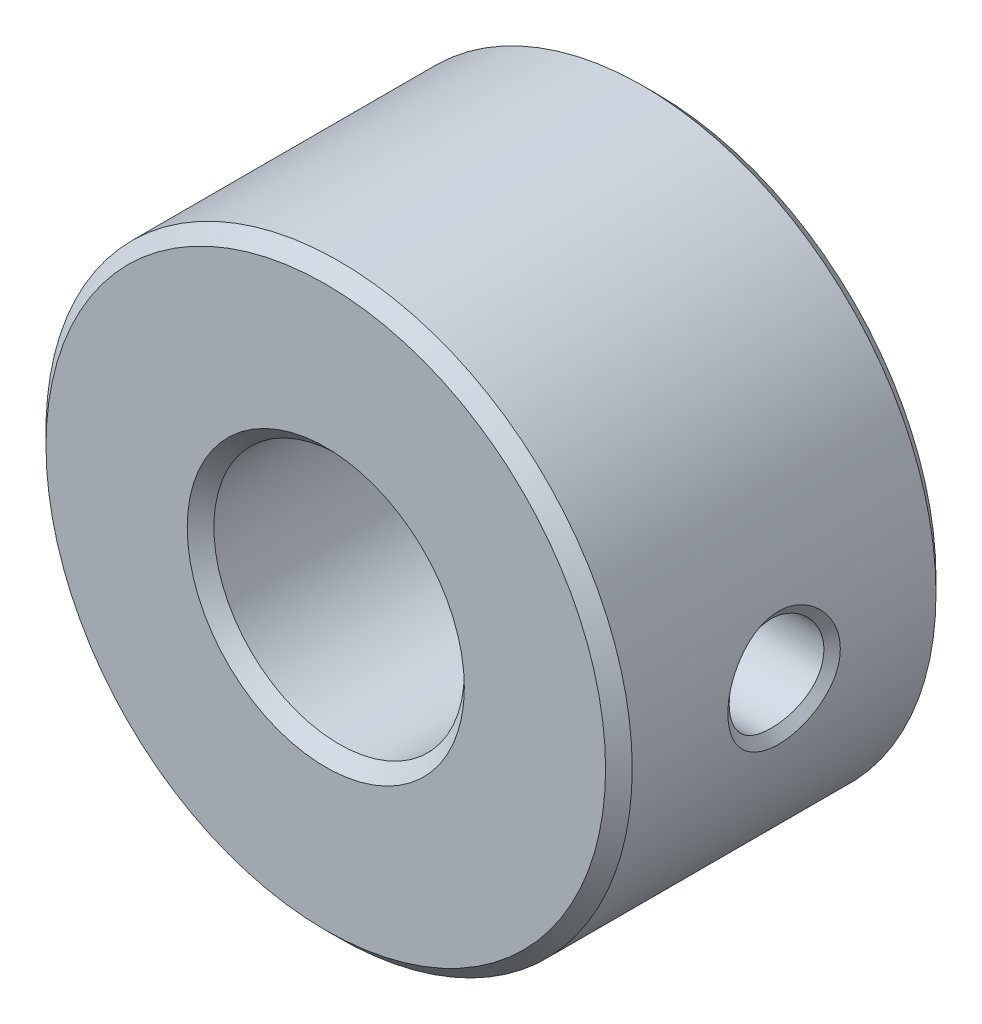
ISO-10303-21;
HEADER;
FILE_DESCRIPTION(('STEP AP214'),'2;1');
FILE_NAME('part.step','',(''),(''),'','','');
FILE_SCHEMA(('AUTOMOTIVE_DESIGN { 1 0 10303 214 1 1 1 1 }'));
ENDSEC;
DATA;
#1=APPLICATION_CONTEXT('core data for automotive mechanical design processes');
#2=APPLICATION_PROTOCOL_DEFINITION('international standard','automotive_design',2000,#1);
#3=PRODUCT_CONTEXT('',#1,'mechanical');
#4=PRODUCT('Part','Part','',(#3));
#5=PRODUCT_RELATED_PRODUCT_CATEGORY('part','',(#4));
#6=PRODUCT_DEFINITION_FORMATION('','',#4);
#7=PRODUCT_DEFINITION_CONTEXT('part definition',#1,'design');
#8=PRODUCT_DEFINITION('design','',#6,#7);
#9=PRODUCT_DEFINITION_SHAPE('','',#8);
#10=(LENGTH_UNIT() NAMED_UNIT(*) SI_UNIT(.MILLI.,.METRE.));
#11=(NAMED_UNIT(*) PLANE_ANGLE_UNIT() SI_UNIT($,.RADIAN.));
#12=(NAMED_UNIT(*) SI_UNIT($,.STERADIAN.) SOLID_ANGLE_UNIT());
#13=UNCERTAINTY_MEASURE_WITH_UNIT(LENGTH_MEASURE(1.E-05),#10,'distance_accuracy_value','');
#14=(GEOMETRIC_REPRESENTATION_CONTEXT(3) GLOBAL_UNCERTAINTY_ASSIGNED_CONTEXT((#13)) GLOBAL_UNIT_ASSIGNED_CONTEXT((#10,
#11,#12)) REPRESENTATION_CONTEXT('',''));
#15=CARTESIAN_POINT('',(0.,0.,0.));
#16=DIRECTION('',(0.,0.,1.));
#17=DIRECTION('',(1.,0.,0.));
#18=AXIS2_PLACEMENT_3D('',#15,#16,#17);
#19=CARTESIAN_POINT('',(0.,0.,-3.1));
#20=DIRECTION('',(0.,0.,1.));
#21=DIRECTION('',(1.,0.,0.));
#22=AXIS2_PLACEMENT_3D('',#19,#20,#21);
#23=CYLINDRICAL_SURFACE('',#22,5.5);
#24=CARTESIAN_POINT('',(5.5,0.,1.05445517417809));
#25=CARTESIAN_POINT('',(5.49999896020636,-0.0587760500050583,1.05445216947384));
#26=CARTESIAN_POINT('',(5.49904821126584,-0.117580576492319,1.04960013701573));
#27=CARTESIAN_POINT('',(5.49534665161718,-0.233534231011388,1.0302117236521));
#28=CARTESIAN_POINT('',(5.49259472262229,-0.290682307580186,1.01566932625227));
#29=CARTESIAN_POINT('',(5.48559027774952,-0.401743932731734,0.977473891884128));
#30=CARTESIAN_POINT('',(5.4813375821966,-0.455657093118598,0.953819764008493));
#31=CARTESIAN_POINT('',(5.47176191891798,-0.559040571617917,0.898217195347256));
#32=CARTESIAN_POINT('',(5.46643674682971,-0.60850143046409,0.866251631238485));
#33=CARTESIAN_POINT('',(5.45499571938975,-0.703869507656749,0.793406345771751));
#34=CARTESIAN_POINT('',(5.44885508389665,-0.749517093762313,0.752190549515752));
#35=CARTESIAN_POINT('',(5.43664239318371,-0.833500494132551,0.6628736362932));
#36=CARTESIAN_POINT('',(5.4305703398318,-0.87183610969594,0.61477233227656));
#37=CARTESIAN_POINT('',(5.41899723927629,-0.941140664304011,0.511127115790833));
#38=CARTESIAN_POINT('',(5.41352107934706,-0.971830552407547,0.455392501688934));
#39=CARTESIAN_POINT('',(5.40413531087428,-1.02273963029988,0.33922834945272));
#40=CARTESIAN_POINT('',(5.40022428671862,-1.04296828678008,0.27880311316901));
#41=CARTESIAN_POINT('',(5.39481500784806,-1.07058952823278,0.159311485043026));
#42=CARTESIAN_POINT('',(5.3931687796178,-1.07877209846978,0.100439438138129));
#43=CARTESIAN_POINT('',(5.3923762817735,-1.08271605936146,0.0118249521786019));
#44=CARTESIAN_POINT('',(5.39239173208748,-1.08264169135826,-0.0177692290999034));
#45=CARTESIAN_POINT('',(5.39297661284685,-1.0797249904411,-0.0768167413581013));
#46=CARTESIAN_POINT('',(5.39354606449186,-1.07688255160313,-0.106270066904415));
#47=CARTESIAN_POINT('',(5.39586876641908,-1.06520609135072,-0.187914008471301));
#48=CARTESIAN_POINT('',(5.39820177552338,-1.05341293578653,-0.239689226629195));
#49=CARTESIAN_POINT('',(5.40424502443843,-1.02195284613962,-0.340679597737544));
#50=CARTESIAN_POINT('',(5.40795602152946,-1.0022815821348,-0.389893326020878));
#51=CARTESIAN_POINT('',(5.41660742866317,-0.954457567838482,-0.487746547031284));
#52=CARTESIAN_POINT('',(5.42161000958073,-0.92585291310056,-0.536159410304942));
#53=CARTESIAN_POINT('',(5.43218043414666,-0.861668557394924,-0.628054789180558));
#54=CARTESIAN_POINT('',(5.43774857766158,-0.826085146820256,-0.671534663129555));
#55=CARTESIAN_POINT('',(5.44949798144761,-0.744862917925946,-0.756887133942376));
#56=CARTESIAN_POINT('',(5.45568348475164,-0.698566742460576,-0.798136163284172));
#57=CARTESIAN_POINT('',(5.46742818057992,-0.599751995803934,-0.872480727533195));
#58=CARTESIAN_POINT('',(5.47298729741344,-0.547232674195469,-0.90557527764897));
#59=CARTESIAN_POINT('',(5.48296145927168,-0.436224345908251,-0.963028372348672));
#60=CARTESIAN_POINT('',(5.48735312350446,-0.377641945218175,-0.987211665936841));
#61=CARTESIAN_POINT('',(5.49432213252549,-0.257030077639985,-1.02488024075925));
#62=CARTESIAN_POINT('',(5.4969000866694,-0.195001776042029,-1.03836911521153));
#63=CARTESIAN_POINT('',(5.49983828794837,-0.0728715082958026,-1.05366828215213));
#64=CARTESIAN_POINT('',(5.5003102653694,-0.0128451476138093,-1.056067203853));
#65=CARTESIAN_POINT('',(5.49928899831789,0.106738912878901,-1.05078008465892));
#66=CARTESIAN_POINT('',(5.49779611835931,0.166296697556492,-1.04309591434723));
#67=CARTESIAN_POINT('',(5.49306057031608,0.282111855788843,-1.0180521613273));
#68=CARTESIAN_POINT('',(5.48985054069155,0.338409754204948,-1.00087285974433));
#69=CARTESIAN_POINT('',(5.48204618004218,0.447390698197375,-0.957669816485664));
#70=CARTESIAN_POINT('',(5.47745160259369,0.500073098231542,-0.931644500278961));
#71=CARTESIAN_POINT('',(5.46720486976661,0.601968982768803,-0.870828079281042));
#72=CARTESIAN_POINT('',(5.46152721764154,0.651048115191046,-0.835816617213848));
#73=CARTESIAN_POINT('',(5.44978420217876,0.742968781136662,-0.758437893859749));
#74=CARTESIAN_POINT('',(5.44371875037234,0.785808883991697,-0.716068950300854));
#75=CARTESIAN_POINT('',(5.43152230698235,0.866200882384876,-0.622636968824208));
#76=CARTESIAN_POINT('',(5.42540404542126,0.903366496466702,-0.571238417038618));
#77=CARTESIAN_POINT('',(5.41419672181722,0.968278556990153,-0.462671109924364));
#78=CARTESIAN_POINT('',(5.40910757826645,0.996025749504273,-0.405502812107012));
#79=CARTESIAN_POINT('',(5.40083515022377,1.03993557409867,-0.288859287707341));
#80=CARTESIAN_POINT('',(5.39759486381485,1.05644810985702,-0.229521096907953));
#81=CARTESIAN_POINT('',(5.39332419630135,1.07804616566032,-0.108755570616923));
#82=CARTESIAN_POINT('',(5.39229040807193,1.08314930390275,-0.0473316050697027));
#83=CARTESIAN_POINT('',(5.39263780314379,1.08141189138572,0.0683148990326293));
#84=CARTESIAN_POINT('',(5.3937577340568,1.075863537526,0.122562062377802));
#85=CARTESIAN_POINT('',(5.39769832636335,1.05591414650463,0.229347188850656));
#86=CARTESIAN_POINT('',(5.40052005819541,1.04150753735923,0.281884054255267));
#87=CARTESIAN_POINT('',(5.4074870106664,1.00470438060552,0.383849659286823));
#88=CARTESIAN_POINT('',(5.41162980571736,0.98232246757917,0.433283898061735));
#89=CARTESIAN_POINT('',(5.42078866935544,0.930452999349249,0.528193084690469));
#90=CARTESIAN_POINT('',(5.42580524039021,0.900961352064953,0.573665731815432));
#91=CARTESIAN_POINT('',(5.43682195918505,0.832054380877992,0.66464826655606));
#92=CARTESIAN_POINT('',(5.44286934372901,0.791897644604223,0.709592210349386));
#93=CARTESIAN_POINT('',(5.45481850387052,0.70489879266957,0.792533387935634));
#94=CARTESIAN_POINT('',(5.460720184184,0.658052431370331,0.830526174904873));
#95=CARTESIAN_POINT('',(5.47206389682312,0.55612999252404,0.900315538286906));
#96=CARTESIAN_POINT('',(5.47746483506484,0.500748866809206,0.931675534720241));
#97=CARTESIAN_POINT('',(5.48679099300324,0.385306536172519,0.984276471464426));
#98=CARTESIAN_POINT('',(5.49071824081634,0.325251901548179,1.00553132947076));
#99=CARTESIAN_POINT('',(5.49573737793324,0.220758146112437,1.0322857658789));
#100=CARTESIAN_POINT('',(5.49732655410275,0.177044915514125,1.04059981614714));
#101=CARTESIAN_POINT('',(5.49945828933617,0.088893248475983,1.05168582063715));
#102=CARTESIAN_POINT('',(5.50000078643914,0.0444547692601643,1.05445744676078));
#103=CARTESIAN_POINT('',(5.5,0.,1.05445517417809));
#104=B_SPLINE_CURVE_WITH_KNOTS('',3,(#24,#25,#26,#27,#28,#29,#30,#31,#32,#33,#34,#35,#36,#37,
#38,#39,#40,#41,#42,#43,#44,#45,#46,#47,#48,#49,#50,#51,#52,#53,#54,#55,#56,#57,#58,#59,#60,#61,
#62,#63,#64,#65,#66,#67,#68,#69,#70,#71,#72,#73,#74,#75,#76,#77,#78,#79,#80,#81,#82,#83,#84,#85,
#86,#87,#88,#89,#90,#91,#92,#93,#94,#95,#96,#97,#98,#99,#100,#101,#102,#103),.UNSPECIFIED.,.T.,
.F.,(4,2,2,2,2,2,2,2,2,2,2,2,2,2,2,2,2,2,2,2,2,2,2,2,2,2,2,2,2,2,2,2,2,2,2,2,2,2,2,4),(0.,
0.176163341926571,0.352436161104831,0.528730091213582,0.705390142462595,0.88999018658587,
1.07459524646263,1.26518389813309,1.45559977711829,1.63286549064132,1.72152785940626,
1.81019362109106,1.96889056634583,2.12767485369593,2.29634765643235,2.46511036258825,
2.65120348243731,2.83731906517888,3.02692088414848,3.2164589717714,3.39581169170395,
3.57513114339216,3.75115738413535,3.92721497278485,4.10808966638342,4.28900577116897,
4.47924494999268,4.66946905565803,4.85345806445704,5.03716276375446,5.19997732129051,
5.36289439669541,5.52551404793793,5.68822752099799,5.86916018665719,6.05020819768013,
6.24087757861294,6.43128358645099,6.56451535625888,6.69775501283279),.UNSPECIFIED.);
#105=CARTESIAN_POINT('',(5.5,0.,-1.0544551740816));
#106=VERTEX_POINT('',#105);
#107=EDGE_CURVE('E9',#106,#106,#104,.F.);
#108=ORIENTED_EDGE('',*,*,#107,.T.);
#109=EDGE_LOOP('',(#108));
#110=FACE_BOUND('',#109,.T.);
#111=CARTESIAN_POINT('',(0.,0.,2.84999999999999));
#112=DIRECTION('',(0.,0.,1.));
#113=DIRECTION('',(1.,0.,0.));
#114=AXIS2_PLACEMENT_3D('',#111,#112,#113);
#115=CIRCLE('',#114,5.5);
#116=CARTESIAN_POINT('',(5.5,0.,2.84999999999999));
#117=VERTEX_POINT('',#116);
#118=EDGE_CURVE('E87',#117,#117,#115,.F.);
#119=ORIENTED_EDGE('',*,*,#118,.T.);
#120=EDGE_LOOP('',(#119));
#121=FACE_BOUND('',#120,.T.);
#122=CARTESIAN_POINT('',(0.,0.,-2.85000000000001));
#123=DIRECTION('',(0.,0.,1.));
#124=DIRECTION('',(1.,0.,0.));
#125=AXIS2_PLACEMENT_3D('',#122,#123,#124);
#126=CIRCLE('',#125,5.5);
#127=CARTESIAN_POINT('',(5.5,0.,-2.85000000000001));
#128=VERTEX_POINT('',#127);
#129=EDGE_CURVE('E91',#128,#128,#126,.T.);
#130=ORIENTED_EDGE('',*,*,#129,.T.);
#131=EDGE_LOOP('',(#130));
#132=FACE_BOUND('',#131,.T.);
#133=ADVANCED_FACE('F13',(#110,#121,#132),#23,.T.);
#134=CARTESIAN_POINT('',(0.,0.,-3.1));
#135=DIRECTION('',(0.,0.,1.));
#136=DIRECTION('',(1.,0.,0.));
#137=AXIS2_PLACEMENT_3D('',#134,#135,#136);
#138=PLANE('',#137);
#139=CARTESIAN_POINT('',(0.,0.,-3.1));
#140=DIRECTION('',(0.,0.,1.));
#141=DIRECTION('',(1.,0.,0.));
#142=AXIS2_PLACEMENT_3D('',#139,#140,#141);
#143=CIRCLE('',#142,5.25000000000001);
#144=CARTESIAN_POINT('',(5.25000000000001,0.,-3.1));
#145=VERTEX_POINT('',#144);
#146=EDGE_CURVE('E34',#145,#145,#143,.F.);
#147=ORIENTED_EDGE('',*,*,#146,.T.);
#148=EDGE_LOOP('',(#147));
#149=FACE_BOUND('',#148,.T.);
#150=CARTESIAN_POINT('',(0.,0.,-3.1));
#151=DIRECTION('',(0.,0.,1.));
#152=DIRECTION('',(1.,0.,0.));
#153=AXIS2_PLACEMENT_3D('',#150,#151,#152);
#154=CIRCLE('',#153,2.6);
#155=CARTESIAN_POINT('',(2.6,0.,-3.1));
#156=VERTEX_POINT('',#155);
#157=EDGE_CURVE('E74',#156,#156,#154,.T.);
#158=ORIENTED_EDGE('',*,*,#157,.T.);
#159=EDGE_LOOP('',(#158));
#160=FACE_BOUND('',#159,.T.);
#161=ADVANCED_FACE('F44',(#149,#160),#138,.F.);
#162=CARTESIAN_POINT('',(0.,0.,3.1));
#163=DIRECTION('',(0.,0.,1.));
#164=DIRECTION('',(1.,0.,0.));
#165=AXIS2_PLACEMENT_3D('',#162,#163,#164);
#166=PLANE('',#165);
#167=CARTESIAN_POINT('',(0.,0.,3.1));
#168=DIRECTION('',(0.,0.,1.));
#169=DIRECTION('',(1.,0.,0.));
#170=AXIS2_PLACEMENT_3D('',#167,#168,#169);
#171=CIRCLE('',#170,5.24999999999999);
#172=CARTESIAN_POINT('',(5.24999999999999,0.,3.1));
#173=VERTEX_POINT('',#172);
#174=EDGE_CURVE('E95',#173,#173,#171,.T.);
#175=ORIENTED_EDGE('',*,*,#174,.T.);
#176=EDGE_LOOP('',(#175));
#177=FACE_BOUND('',#176,.T.);
#178=CARTESIAN_POINT('',(0.,0.,3.1));
#179=DIRECTION('',(0.,0.,1.));
#180=DIRECTION('',(1.,0.,0.));
#181=AXIS2_PLACEMENT_3D('',#178,#179,#180);
#182=CIRCLE('',#181,2.59999999999999);
#183=CARTESIAN_POINT('',(2.59999999999999,0.,3.1));
#184=VERTEX_POINT('',#183);
#185=EDGE_CURVE('E99',#184,#184,#182,.F.);
#186=ORIENTED_EDGE('',*,*,#185,.T.);
#187=EDGE_LOOP('',(#186));
#188=FACE_BOUND('',#187,.T.);
#189=ADVANCED_FACE('F45',(#177,#188),#166,.T.);
#190=CARTESIAN_POINT('',(0.,0.,-3.1));
#191=DIRECTION('',(0.,0.,1.));
#192=DIRECTION('',(1.,0.,0.));
#193=AXIS2_PLACEMENT_3D('',#190,#191,#192);
#194=CYLINDRICAL_SURFACE('',#193,2.35);
#195=CARTESIAN_POINT('',(2.35,0.,-0.888999999999999));
#196=CARTESIAN_POINT('',(2.35000140707631,0.048115186925079,-0.889001866284343));
#197=CARTESIAN_POINT('',(2.34850950605383,0.0962177098448817,-0.885081647398307));
#198=CARTESIAN_POINT('',(2.34270733382693,0.190983546485089,-0.869569155087926));
#199=CARTESIAN_POINT('',(2.33839752310871,0.237647094049921,-0.857978135176902));
#200=CARTESIAN_POINT('',(2.32742165295812,0.328154472471897,-0.827593752956557));
#201=CARTESIAN_POINT('',(2.32076018973228,0.372003607811834,-0.808814433885862));
#202=CARTESIAN_POINT('',(2.30574318032279,0.45592547640493,-0.764658613959366));
#203=CARTESIAN_POINT('',(2.29738717154624,0.495997174072754,-0.739280311116151));
#204=CARTESIAN_POINT('',(2.2794398248948,0.572954183020897,-0.681504813032714));
#205=CARTESIAN_POINT('',(2.26981310169239,0.609655171499627,-0.648873197353185));
#206=CARTESIAN_POINT('',(2.25058186695365,0.677212859462352,-0.578015009261017));
#207=CARTESIAN_POINT('',(2.24097736332329,0.70806772388726,-0.539786686732563));
#208=CARTESIAN_POINT('',(2.22246434388203,0.764239837865894,-0.457007170612021));
#209=CARTESIAN_POINT('',(2.21359744468071,0.7892949345214,-0.412267843813389));
#210=CARTESIAN_POINT('',(2.19811523889301,0.831442921290767,-0.318822304459222));
#211=CARTESIAN_POINT('',(2.19149901517726,0.84853905565705,-0.270117717761382));
#212=CARTESIAN_POINT('',(2.18164612219023,0.873553208967144,-0.172247378355854));
#213=CARTESIAN_POINT('',(2.17828031741972,0.881823440129958,-0.123185089673674));
#214=CARTESIAN_POINT('',(2.17493192069827,0.890052178585222,-0.0242625068748073));
#215=CARTESIAN_POINT('',(2.174947899632,0.890014196863178,0.0255974412499916));
#216=CARTESIAN_POINT('',(2.17825007686314,0.881896592517579,0.12145716040321));
#217=CARTESIAN_POINT('',(2.18133648206428,0.874308266703005,0.167506703079702));
#218=CARTESIAN_POINT('',(2.19009929043634,0.852118474357127,0.257622345570875));
#219=CARTESIAN_POINT('',(2.19577609071786,0.837515932520196,0.301688140136281));
#220=CARTESIAN_POINT('',(2.20919860485616,0.801446537300097,0.387577292023376));
#221=CARTESIAN_POINT('',(2.21698181336035,0.779853734667864,0.42934163850231));
#222=CARTESIAN_POINT('',(2.23372797429106,0.730504628502734,0.508795673366254));
#223=CARTESIAN_POINT('',(2.2426913386182,0.702746170684489,0.546483930701603));
#224=CARTESIAN_POINT('',(2.26153660542259,0.639615589040909,0.61943159596374));
#225=CARTESIAN_POINT('',(2.27143937223554,0.603852213440843,0.654347854151304));
#226=CARTESIAN_POINT('',(2.29052063956349,0.526864749477631,0.717790313031165));
#227=CARTESIAN_POINT('',(2.29969902464782,0.485639793600652,0.746315496628208));
#228=CARTESIAN_POINT('',(2.31648562497801,0.398011544653526,0.796553553775788));
#229=CARTESIAN_POINT('',(2.32406639558356,0.351536009233306,0.818150242908417));
#230=CARTESIAN_POINT('',(2.33659954969463,0.25525304126368,0.853104091653567));
#231=CARTESIAN_POINT('',(2.34155312194585,0.205447127140078,0.866464978218503));
#232=CARTESIAN_POINT('',(2.34806379294274,0.106803720431817,0.88390385592193));
#233=CARTESIAN_POINT('',(2.34978972859306,0.0580589698750885,0.888443812242127));
#234=CARTESIAN_POINT('',(2.35017371174371,-0.0395208918615776,0.889459542903284));
#235=CARTESIAN_POINT('',(2.34883245377216,-0.0883559800836499,0.885937142865119));
#236=CARTESIAN_POINT('',(2.34334405086432,-0.182721432554753,0.871277856882935));
#237=CARTESIAN_POINT('',(2.3393090926069,-0.228306275652867,0.860445237049264));
#238=CARTESIAN_POINT('',(2.32895235850414,-0.316978076513538,0.831875351825645));
#239=CARTESIAN_POINT('',(2.32263028544657,-0.360064708787047,0.814137189032529));
#240=CARTESIAN_POINT('',(2.30808985048739,-0.443945642192283,0.771691699404412));
#241=CARTESIAN_POINT('',(2.2998209393578,-0.484634472416177,0.746793789235255));
#242=CARTESIAN_POINT('',(2.28229915052854,-0.561393961141101,0.690950456954975));
#243=CARTESIAN_POINT('',(2.27304590568957,-0.597462885364259,0.660002774753957));
#244=CARTESIAN_POINT('',(2.25389472210002,-0.666187718938294,0.590788536511787));
#245=CARTESIAN_POINT('',(2.24399098311874,-0.69851625618747,0.552197681603637));
#246=CARTESIAN_POINT('',(2.22518056285627,-0.756305276977009,0.469946293881352));
#247=CARTESIAN_POINT('',(2.21627397980038,-0.781765084257673,0.426285262488702));
#248=CARTESIAN_POINT('',(2.20049754418703,-0.825135455645648,0.334736878533443));
#249=CARTESIAN_POINT('',(2.1936376612401,-0.843009240506266,0.286830266935531));
#250=CARTESIAN_POINT('',(2.1829496519933,-0.87031603048621,0.188354455361436));
#251=CARTESIAN_POINT('',(2.17911960480811,-0.879754384077325,0.137786964082003));
#252=CARTESIAN_POINT('',(2.17518303078595,-0.889440006010089,0.0389791697308565));
#253=CARTESIAN_POINT('',(2.17484985703114,-0.890246793174503,-0.00919769622599497));
#254=CARTESIAN_POINT('',(2.17736205525583,-0.884084481019557,-0.104962408624742));
#255=CARTESIAN_POINT('',(2.18020711463272,-0.877116146440682,-0.15255031252995));
#256=CARTESIAN_POINT('',(2.18856506928263,-0.856039915463804,-0.244257231186627));
#257=CARTESIAN_POINT('',(2.19399078321103,-0.842164685389258,-0.288438349406605));
#258=CARTESIAN_POINT('',(2.2068465024456,-0.807875067228952,-0.373870351620757));
#259=CARTESIAN_POINT('',(2.21427701853517,-0.787459012423346,-0.415120485470494));
#260=CARTESIAN_POINT('',(2.23079571551651,-0.739410302866601,-0.49590092479153));
#261=CARTESIAN_POINT('',(2.23995095186575,-0.711452101394908,-0.53522370612719));
#262=CARTESIAN_POINT('',(2.25866014857737,-0.649612983879455,-0.60879807450977));
#263=CARTESIAN_POINT('',(2.26821423604695,-0.61573016862088,-0.643048028870975));
#264=CARTESIAN_POINT('',(2.28728117248565,-0.540758311258718,-0.707442747205063));
#265=CARTESIAN_POINT('',(2.29676234625137,-0.49937382413809,-0.73725447983383));
#266=CARTESIAN_POINT('',(2.31405900429282,-0.411848691517378,-0.78949288857394));
#267=CARTESIAN_POINT('',(2.32187430846855,-0.365707532564603,-0.811918766330602));
#268=CARTESIAN_POINT('',(2.33527961532088,-0.267477134521013,-0.84951666464526));
#269=CARTESIAN_POINT('',(2.34073649042164,-0.215204842707235,-0.864262588368513));
#270=CARTESIAN_POINT('',(2.34809495563215,-0.108615598578685,-0.884000642838147));
#271=CARTESIAN_POINT('',(2.34999841206332,-0.0542997348876734,-0.888997893830376));
#272=CARTESIAN_POINT('',(2.35,0.,-0.888999999999999));
#273=B_SPLINE_CURVE_WITH_KNOTS('',3,(#195,#196,#197,#198,#199,#200,#201,#202,#203,#204,#205,
#206,#207,#208,#209,#210,#211,#212,#213,#214,#215,#216,#217,#218,#219,#220,#221,#222,#223,#224,
#225,#226,#227,#228,#229,#230,#231,#232,#233,#234,#235,#236,#237,#238,#239,#240,#241,#242,#243,
#244,#245,#246,#247,#248,#249,#250,#251,#252,#253,#254,#255,#256,#257,#258,#259,#260,#261,#262,
#263,#264,#265,#266,#267,#268,#269,#270,#271,#272),.UNSPECIFIED.,.T.,.F.,(4,2,2,2,2,2,2,2,2,2,2,
2,2,2,2,2,2,2,2,2,2,2,2,2,2,2,2,2,2,2,2,2,2,2,2,2,2,2,4),(0.,0.144145243594158,
0.288266937707596,0.432108497409597,0.575989377314956,0.72546118440935,0.874979832252769,
1.03031569330107,1.18558818039032,1.33440156217599,1.48315205671698,1.62281739456641,
1.76250415047286,1.9048626459388,2.04727096005129,2.1994329461631,2.35161913062786,
2.5062380285989,2.66078690532585,2.80699705804123,2.95317410655136,3.09361424198755,
3.23407263428154,3.3786847403281,3.52335097455127,3.67656097071541,3.82978604564474,
3.983745741481,4.13760775002091,4.28143055458225,4.42523921435844,4.56450166370071,
4.70379962788388,4.85049184671042,4.99723117620423,5.15210887457551,5.30700330855655,
5.46976195594722,5.63243509540046),.UNSPECIFIED.);
#274=CARTESIAN_POINT('',(2.35,0.,-0.888999999999999));
#275=VERTEX_POINT('',#274);
#276=EDGE_CURVE('E103',#275,#275,#273,.T.);
#277=ORIENTED_EDGE('',*,*,#276,.T.);
#278=EDGE_LOOP('',(#277));
#279=FACE_BOUND('',#278,.T.);
#280=CARTESIAN_POINT('',(0.,0.,2.85000000000001));
#281=DIRECTION('',(0.,0.,1.));
#282=DIRECTION('',(1.,0.,0.));
#283=AXIS2_PLACEMENT_3D('',#280,#281,#282);
#284=CIRCLE('',#283,2.35);
#285=CARTESIAN_POINT('',(2.35,0.,2.85000000000001));
#286=VERTEX_POINT('',#285);
#287=EDGE_CURVE('E77',#286,#286,#284,.T.);
#288=ORIENTED_EDGE('',*,*,#287,.T.);
#289=EDGE_LOOP('',(#288));
#290=FACE_BOUND('',#289,.T.);
#291=CARTESIAN_POINT('',(0.,0.,-2.84999999999999));
#292=DIRECTION('',(0.,0.,1.));
#293=DIRECTION('',(1.,0.,0.));
#294=AXIS2_PLACEMENT_3D('',#291,#292,#293);
#295=CIRCLE('',#294,2.35);
#296=CARTESIAN_POINT('',(2.35,0.,-2.84999999999999));
#297=VERTEX_POINT('',#296);
#298=EDGE_CURVE('E71',#297,#297,#295,.F.);
#299=ORIENTED_EDGE('',*,*,#298,.T.);
#300=EDGE_LOOP('',(#299));
#301=FACE_BOUND('',#300,.T.);
#302=ADVANCED_FACE('F51',(#279,#290,#301),#194,.F.);
#303=CARTESIAN_POINT('',(0.,0.,3.1));
#304=DIRECTION('',(0.,0.,-1.));
#305=DIRECTION('',(-1.,0.,0.));
#306=AXIS2_PLACEMENT_3D('',#303,#304,#305);
#307=CONICAL_SURFACE('',#306,5.24999999999999,0.785398163397447);
#308=ORIENTED_EDGE('',*,*,#118,.F.);
#309=EDGE_LOOP('',(#308));
#310=FACE_BOUND('',#309,.T.);
#311=ORIENTED_EDGE('',*,*,#174,.F.);
#312=EDGE_LOOP('',(#311));
#313=FACE_BOUND('',#312,.T.);
#314=ADVANCED_FACE('F47',(#310,#313),#307,.T.);
#315=CARTESIAN_POINT('',(0.,0.,2.85000000000001));
#316=DIRECTION('',(0.,0.,1.));
#317=DIRECTION('',(1.,0.,0.));
#318=AXIS2_PLACEMENT_3D('',#315,#316,#317);
#319=CONICAL_SURFACE('',#318,2.35,0.785398163397448);
#320=ORIENTED_EDGE('',*,*,#185,.F.);
#321=EDGE_LOOP('',(#320));
#322=FACE_BOUND('',#321,.T.);
#323=ORIENTED_EDGE('',*,*,#287,.F.);
#324=EDGE_LOOP('',(#323));
#325=FACE_BOUND('',#324,.T.);
#326=ADVANCED_FACE('F50',(#322,#325),#319,.F.);
#327=CARTESIAN_POINT('',(0.,0.,-2.85000000000001));
#328=DIRECTION('',(0.,0.,1.));
#329=DIRECTION('',(1.,0.,0.));
#330=AXIS2_PLACEMENT_3D('',#327,#328,#329);
#331=CONICAL_SURFACE('',#330,5.5,0.785398163397445);
#332=ORIENTED_EDGE('',*,*,#146,.F.);
#333=EDGE_LOOP('',(#332));
#334=FACE_BOUND('',#333,.T.);
#335=ORIENTED_EDGE('',*,*,#129,.F.);
#336=EDGE_LOOP('',(#335));
#337=FACE_BOUND('',#336,.T.);
#338=ADVANCED_FACE('F55',(#334,#337),#331,.T.);
#339=CARTESIAN_POINT('',(0.,0.,-3.1));
#340=DIRECTION('',(0.,0.,-1.));
#341=DIRECTION('',(-1.,0.,0.));
#342=AXIS2_PLACEMENT_3D('',#339,#340,#341);
#343=CONICAL_SURFACE('',#342,2.6,0.785398163397446);
#344=ORIENTED_EDGE('',*,*,#298,.F.);
#345=EDGE_LOOP('',(#344));
#346=FACE_BOUND('',#345,.T.);
#347=ORIENTED_EDGE('',*,*,#157,.F.);
#348=EDGE_LOOP('',(#347));
#349=FACE_BOUND('',#348,.T.);
#350=ADVANCED_FACE('F58',(#346,#349),#343,.F.);
#351=CARTESIAN_POINT('',(5.5,0.,0.));
#352=DIRECTION('',(1.,0.,0.));
#353=DIRECTION('',(0.,0.,-1.));
#354=AXIS2_PLACEMENT_3D('',#351,#352,#353);
#355=CYLINDRICAL_SURFACE('',#354,0.888999999999998);
#356=CARTESIAN_POINT('',(5.35831177089902,3.79950362261439E-06,0.888999999991879));
#357=CARTESIAN_POINT('',(5.35831224533504,0.0436548334475568,0.888996526825017));
#358=CARTESIAN_POINT('',(5.35764107438412,0.0873533007172923,0.885772414923842));
#359=CARTESIAN_POINT('',(5.35510460051667,0.173833441695286,0.872938906972025));
#360=CARTESIAN_POINT('',(5.35323667666963,0.216612889667503,0.863315494472386));
#361=CARTESIAN_POINT('',(5.34813133309672,0.305403248109928,0.836334850193999));
#362=CARTESIAN_POINT('',(5.34475369090224,0.351164143286734,0.818171748999445));
#363=CARTESIAN_POINT('',(5.33685074335125,0.438974388701115,0.774613578585351));
#364=CARTESIAN_POINT('',(5.33232559231707,0.481024236993253,0.749219481767274));
#365=CARTESIAN_POINT('',(5.32236561459367,0.560824057860689,0.691556873722402));
#366=CARTESIAN_POINT('',(5.31691988952241,0.598512130112738,0.659204562437607));
#367=CARTESIAN_POINT('',(5.30561785812981,0.667965254150998,0.588721331063398));
#368=CARTESIAN_POINT('',(5.2997614665285,0.699729070650685,0.550589208804053));
#369=CARTESIAN_POINT('',(5.28816625248835,0.756922254872375,0.468945704300494));
#370=CARTESIAN_POINT('',(5.28243050706607,0.782249563618223,0.425362273695753));
#371=CARTESIAN_POINT('',(5.27194961758761,0.825222186869189,0.334452553336695));
#372=CARTESIAN_POINT('',(5.26720443057816,0.842867834507846,0.287126425998543));
#373=CARTESIAN_POINT('',(5.25957867743416,0.869828422130301,0.190320656989433));
#374=CARTESIAN_POINT('',(5.25668572538613,0.879198861985736,0.140857732538868));
#375=CARTESIAN_POINT('',(5.25423973639409,0.886902338047531,0.0660090638726724));
#376=CARTESIAN_POINT('',(5.25374009133727,0.888411050630981,0.0409441452686459));
#377=CARTESIAN_POINT('',(5.25343411037331,0.889306061687754,-0.00922871420917852));
#378=CARTESIAN_POINT('',(5.25362778169735,0.88869233802437,-0.0343366555289672));
#379=CARTESIAN_POINT('',(5.25516727494191,0.883801340274851,-0.107346663051717));
#380=CARTESIAN_POINT('',(5.25740565257628,0.876684199762017,-0.155070286995141));
#381=CARTESIAN_POINT('',(5.26374722040416,0.854883863399521,-0.248607859536167));
#382=CARTESIAN_POINT('',(5.26785106467527,0.840198013536018,-0.294421132162372));
#383=CARTESIAN_POINT('',(5.27726097785867,0.803452246599083,-0.383589344164926));
#384=CARTESIAN_POINT('',(5.28258253395596,0.781295423650414,-0.426902729379435));
#385=CARTESIAN_POINT('',(5.29365892313777,0.730258313734181,-0.509307342859346));
#386=CARTESIAN_POINT('',(5.29941381915716,0.701377048882667,-0.548397955827845));
#387=CARTESIAN_POINT('',(5.31092203860987,0.636508212874487,-0.622648492779627));
#388=CARTESIAN_POINT('',(5.31666835904395,0.600308586773918,-0.657624638258675));
#389=CARTESIAN_POINT('',(5.32740823651528,0.522451741618501,-0.721031680549662));
#390=CARTESIAN_POINT('',(5.33240155239823,0.48079278212833,-0.749460482065055));
#391=CARTESIAN_POINT('',(5.34124914843105,0.393246995867973,-0.798873615235813));
#392=CARTESIAN_POINT('',(5.34510529424985,0.347367257928643,-0.819870151914833));
#393=CARTESIAN_POINT('',(5.35143999630548,0.252705562631727,-0.853807418739841));
#394=CARTESIAN_POINT('',(5.35392046097115,0.203927730285983,-0.866759311914646));
#395=CARTESIAN_POINT('',(5.35728255441928,0.106262774515418,-0.883974337557624));
#396=CARTESIAN_POINT('',(5.35820910436003,0.0574211476622551,-0.888482048555342));
#397=CARTESIAN_POINT('',(5.35835033709362,-0.0157538618314192,-0.889196024308819));
#398=CARTESIAN_POINT('',(5.35819035006625,-0.0400987832347468,-0.8884310799007));
#399=CARTESIAN_POINT('',(5.35711449630411,-0.113359957967853,-0.883104843178069));
#400=CARTESIAN_POINT('',(5.35559541324994,-0.162087919387324,-0.87547404952653));
#401=CARTESIAN_POINT('',(5.35113921437275,-0.257626258679373,-0.852277101879335));
#402=CARTESIAN_POINT('',(5.34819903872887,-0.304432261259106,-0.836693820950562));
#403=CARTESIAN_POINT('',(5.34108459407137,-0.394694902682171,-0.798086047423877));
#404=CARTESIAN_POINT('',(5.33691202880035,-0.438156061792634,-0.775071823819329));
#405=CARTESIAN_POINT('',(5.32759801179497,-0.520604354756064,-0.722279992928332));
#406=CARTESIAN_POINT('',(5.32245698910379,-0.559593457547183,-0.692505379415572));
#407=CARTESIAN_POINT('',(5.31150075231791,-0.632771712863351,-0.626414662062153));
#408=CARTESIAN_POINT('',(5.30567500985531,-0.666861088899169,-0.589989802511027));
#409=CARTESIAN_POINT('',(5.29400142584618,-0.728491116300408,-0.511952221407406));
#410=CARTESIAN_POINT('',(5.28815357753089,-0.756029563020988,-0.470337760511733));
#411=CARTESIAN_POINT('',(5.27709953305695,-0.8040823793023,-0.382501649448585));
#412=CARTESIAN_POINT('',(5.27190168648005,-0.824510386356189,-0.336231597159433));
#413=CARTESIAN_POINT('',(5.26307802821129,-0.857259597905102,-0.240772493996551));
#414=CARTESIAN_POINT('',(5.25945161635742,-0.869583898298154,-0.191584565691808));
#415=CARTESIAN_POINT('',(5.25463880749776,-0.88553521445158,-0.0927427827578853));
#416=CARTESIAN_POINT('',(5.25340330556339,-0.889337521261526,-0.0431198140327512));
#417=CARTESIAN_POINT('',(5.25369101557906,-0.888615439282222,0.0560531122473689));
#418=CARTESIAN_POINT('',(5.25521390119878,-0.884092035462944,0.105603077744925));
#419=CARTESIAN_POINT('',(5.26035619179384,-0.867201317917968,0.20141237568156));
#420=CARTESIAN_POINT('',(5.26389996325946,-0.855115526016204,0.247726148553563));
#421=CARTESIAN_POINT('',(5.27234469109851,-0.823735415246535,0.337716861052413));
#422=CARTESIAN_POINT('',(5.27724599290619,-0.804439261208506,0.381393126094661));
#423=CARTESIAN_POINT('',(5.2878794695731,-0.758363288442504,0.466507188774125));
#424=CARTESIAN_POINT('',(5.29363471425389,-0.731345262723462,0.507813208705311));
#425=CARTESIAN_POINT('',(5.30514144408552,-0.670861729323422,0.585392879570783));
#426=CARTESIAN_POINT('',(5.31089292940271,-0.637396529502106,0.621666770652574));
#427=CARTESIAN_POINT('',(5.32195742677353,-0.564075797882626,0.688962621768835));
#428=CARTESIAN_POINT('',(5.32725794679736,-0.524095436338473,0.719850869964806));
#429=CARTESIAN_POINT('',(5.33684638216463,-0.439369883492616,0.774477934919411));
#430=CARTESIAN_POINT('',(5.34113373787514,-0.394622078543912,0.798212802409912));
#431=CARTESIAN_POINT('',(5.34837352356644,-0.302086174480403,0.837599465936909));
#432=CARTESIAN_POINT('',(5.35133761293291,-0.254329039135172,0.853322040405263));
#433=CARTESIAN_POINT('',(5.35578724664423,-0.156867198703464,0.876476126770209));
#434=CARTESIAN_POINT('',(5.35727655964634,-0.107167796882011,0.883928777621606));
#435=CARTESIAN_POINT('',(5.35818272131388,-0.0381932377637111,0.88838621933729));
#436=CARTESIAN_POINT('',(5.35831156327094,-0.0190992613737302,0.889001519958578));
#437=CARTESIAN_POINT('',(5.35831177089902,3.79950362261439E-06,0.888999999991879));
#438=B_SPLINE_CURVE_WITH_KNOTS('',3,(#356,#357,#358,#359,#360,#361,#362,#363,#364,#365,#366,
#367,#368,#369,#370,#371,#372,#373,#374,#375,#376,#377,#378,#379,#380,#381,#382,#383,#384,#385,
#386,#387,#388,#389,#390,#391,#392,#393,#394,#395,#396,#397,#398,#399,#400,#401,#402,#403,#404,
#405,#406,#407,#408,#409,#410,#411,#412,#413,#414,#415,#416,#417,#418,#419,#420,#421,#422,#423,
#424,#425,#426,#427,#428,#429,#430,#431,#432,#433,#434,#435,#436,#437),.UNSPECIFIED.,.T.,.F.,(4,
2,2,2,2,2,2,2,2,2,2,2,2,2,2,2,2,2,2,2,2,2,2,2,2,2,2,2,2,2,2,2,2,2,2,2,2,2,2,2,4),(0.,
0.130911705780456,0.262111097356233,0.409452959098303,0.556775016121807,0.705982040987555,
0.85522014281538,1.0066946736392,1.15816263475448,1.30860684743402,1.38386639895941,
1.45912673543348,1.60329598548601,1.74751582379167,1.89368330092436,2.03987204736171,
2.1911404723584,2.34245723957595,2.4935243537703,2.64438137086407,2.79079702421507,
2.86381175302968,3.01107558828907,3.15865792633707,3.30603718357295,3.45335130217631,
3.60333475087167,3.75336860370091,3.90516589357452,4.05690515785366,4.20549344526166,
4.35406415511975,4.49740860679099,4.64078956714645,4.78918690942884,4.93757716732986,
5.0892452833292,5.2409969801512,5.39138383709837,5.54138539462028,5.59867646104254),.UNSPECIFIED.);
#439=CARTESIAN_POINT('',(5.35831177090091,0.,-0.888999999999998));
#440=VERTEX_POINT('',#439);
#441=EDGE_CURVE('E20',#440,#440,#438,.F.);
#442=ORIENTED_EDGE('',*,*,#441,.T.);
#443=EDGE_LOOP('',(#442));
#444=FACE_BOUND('',#443,.T.);
#445=ORIENTED_EDGE('',*,*,#276,.F.);
#446=EDGE_LOOP('',(#445));
#447=FACE_BOUND('',#446,.T.);
#448=ADVANCED_FACE('F61',(#444,#447),#355,.F.);
#449=CARTESIAN_POINT('',(5.35684003425621,0.,-0.887281392573681));
#450=CARTESIAN_POINT('',(5.35684465521545,0.475350522997476,-0.88727432062337));
#451=CARTESIAN_POINT('',(5.25213347802841,0.886994697016146,-0.475823754118131));
#452=CARTESIAN_POINT('',(5.2520505168638,0.886988678206801,0.475052234057729));
#453=CARTESIAN_POINT('',(5.35683257749342,0.476400814494575,0.88726207509216));
#454=CARTESIAN_POINT('',(5.35684749101521,-0.476393232653295,0.887300710038994));
#455=CARTESIAN_POINT('',(5.25205983459803,-0.886924532948674,0.474884141211094));
#456=CARTESIAN_POINT('',(5.25212419398314,-0.887058701045952,-0.475931348851933));
#457=CARTESIAN_POINT('',(5.35683541329696,-0.475350522997476,-0.887288464523992));
#458=CARTESIAN_POINT('',(5.35684003425621,0.,-0.887281392573681));
#459=CARTESIAN_POINT('',(5.35831177090091,0.,-0.888999999999998));
#460=CARTESIAN_POINT('',(5.35831639312863,0.476426625515683,-0.888992914353705));
#461=CARTESIAN_POINT('',(5.25357644762927,0.889002932198455,-0.476745452976121));
#462=CARTESIAN_POINT('',(5.25349346366312,0.888996899761226,0.475972438530605));
#463=CARTESIAN_POINT('',(5.35830431209106,0.477479306212355,0.888980645106575));
#464=CARTESIAN_POINT('',(5.35831922970697,-0.47747170720511,0.889019354877183));
#465=CARTESIAN_POINT('',(5.25350278395826,-0.888932609264352,0.475804020388357));
#466=CARTESIAN_POINT('',(5.25356716103233,-0.889067081147255,-0.476853256403557));
#467=CARTESIAN_POINT('',(5.3583071486732,-0.476426625515683,-0.889007085646292));
#468=CARTESIAN_POINT('',(5.35831177090091,0.,-0.888999999999998));
#469=CARTESIAN_POINT('',(5.5,0.,-1.0544551740816));
#470=CARTESIAN_POINT('',(5.500004744347,0.580026043715092,-1.05444676988451));
#471=CARTESIAN_POINT('',(5.39249519245081,1.08234138552855,-0.565479996225667));
#472=CARTESIAN_POINT('',(5.39241001331549,1.08233404109659,0.564563113119124));
#473=CARTESIAN_POINT('',(5.49999234411375,0.581308739379196,1.05443221743905));
#474=CARTESIAN_POINT('',(5.50000765588236,-0.581299487756133,1.05447813070488));
#475=CARTESIAN_POINT('',(5.39241958015795,-1.08225576805672,0.564363377852685));
#476=CARTESIAN_POINT('',(5.39248566019764,-1.08241948623678,-0.565607891176715));
#477=CARTESIAN_POINT('',(5.499995255653,-0.580026043715091,-1.05446357827869));
#478=CARTESIAN_POINT('',(5.5,0.,-1.0544551740816));
#479=CARTESIAN_POINT('',(5.50242186574865,0.,-1.0572832863503));
#480=CARTESIAN_POINT('',(5.50242661218303,0.58179686041675,-1.05727485961532));
#481=CARTESIAN_POINT('',(5.39486971962268,1.08564610449493,-0.566996728789723));
#482=CARTESIAN_POINT('',(5.3947845029655,1.08563873763715,0.56607738654748));
#483=CARTESIAN_POINT('',(5.50241420649378,0.58308348770859,1.05726026814334));
#484=CARTESIAN_POINT('',(5.50242952499962,-0.583074207837495,1.05730630453794));
#485=CARTESIAN_POINT('',(5.39479407402217,-1.08556022559477,0.565877115979902));
#486=CARTESIAN_POINT('',(5.39486018317051,-1.08572444367949,-0.567124967163603));
#487=CARTESIAN_POINT('',(5.50241711931427,-0.58179686041675,-1.05729171308527));
#488=CARTESIAN_POINT('',(5.50242186574865,0.,-1.0572832863503));
#489=B_SPLINE_SURFACE_WITH_KNOTS('',1,3,((#449,#450,#451,#452,#453,#454,#455,#456,#457,#458),
(#459,#460,#461,#462,#463,#464,#465,#466,#467,#468),(#469,#470,#471,#472,#473,#474,#475,#476,
#477,#478),(#479,#480,#481,#482,#483,#484,#485,#486,#487,#488)),.UNSPECIFIED.,.F.,.T.,.F.,(2,1,
1,2),(4,2,2,2,4),(-0.0103871482766065,0.,1.,1.01709292129662),(-0.0066043131657145,
-0.00495192706341636,-0.00329954096111823,-0.00164715485882009,5.23124347804119E-06),.UNSPECIFIED.);
#490=CARTESIAN_POINT('',(5.5,0.,-1.0544551740816));
#491=CARTESIAN_POINT('',(5.49852408094688,0.,-1.05273168268492));
#492=CARTESIAN_POINT('',(5.49704816189377,0.,-1.05100819128823));
#493=CARTESIAN_POINT('',(5.49409632378754,0.,-1.04756120849487));
#494=CARTESIAN_POINT('',(5.49262040473442,0.,-1.04583771709818));
#495=CARTESIAN_POINT('',(5.48966856662819,0.,-1.04239073430482));
#496=CARTESIAN_POINT('',(5.48819264757508,0.,-1.04066724290813));
#497=CARTESIAN_POINT('',(5.48524080946884,0.,-1.03722026011477));
#498=CARTESIAN_POINT('',(5.48376489041573,0.,-1.03549676871808));
#499=CARTESIAN_POINT('',(5.4808130523095,0.,-1.03204978592472));
#500=CARTESIAN_POINT('',(5.47933713325638,0.,-1.03032629452803));
#501=CARTESIAN_POINT('',(5.47638529515015,0.,-1.02687931173467));
#502=CARTESIAN_POINT('',(5.47490937609704,0.,-1.02515582033798));
#503=CARTESIAN_POINT('',(5.47195753799081,0.,-1.02170883754462));
#504=CARTESIAN_POINT('',(5.47048161893769,0.,-1.01998534614793));
#505=CARTESIAN_POINT('',(5.46752978083146,0.,-1.01653836335457));
#506=CARTESIAN_POINT('',(5.46605386177834,0.,-1.01481487195788));
#507=CARTESIAN_POINT('',(5.46310202367211,0.,-1.01136788916452));
#508=CARTESIAN_POINT('',(5.461626104619,0.,-1.00964439776783));
#509=CARTESIAN_POINT('',(5.45867426651276,0.,-1.00619741497447));
#510=CARTESIAN_POINT('',(5.45719834745965,0.,-1.00447392357778));
#511=CARTESIAN_POINT('',(5.45424650935342,0.,-1.00102694078442));
#512=CARTESIAN_POINT('',(5.4527705903003,0.,-0.999303449387734));
#513=CARTESIAN_POINT('',(5.44981875219407,0.,-0.995856466594367));
#514=CARTESIAN_POINT('',(5.44834283314096,0.,-0.994132975197684));
#515=CARTESIAN_POINT('',(5.44539099503473,0.,-0.990685992404317));
#516=CARTESIAN_POINT('',(5.44391507598161,0.,-0.988962501007634));
#517=CARTESIAN_POINT('',(5.44096323787538,0.,-0.985515518214267));
#518=CARTESIAN_POINT('',(5.43948731882226,0.,-0.983792026817584));
#519=CARTESIAN_POINT('',(5.43653548071603,0.,-0.980345044024217));
#520=CARTESIAN_POINT('',(5.43505956166292,0.,-0.978621552627533));
#521=CARTESIAN_POINT('',(5.43210772355669,0.,-0.975174569834167));
#522=CARTESIAN_POINT('',(5.43063180450357,0.,-0.973451078437483));
#523=CARTESIAN_POINT('',(5.42767996639734,0.,-0.970004095644117));
#524=CARTESIAN_POINT('',(5.42620404734422,0.,-0.968280604247433));
#525=CARTESIAN_POINT('',(5.42325220923799,0.,-0.964833621454066));
#526=CARTESIAN_POINT('',(5.42177629018488,0.,-0.963110130057383));
#527=CARTESIAN_POINT('',(5.41882445207865,0.,-0.959663147264016));
#528=CARTESIAN_POINT('',(5.41734853302553,0.,-0.957939655867333));
#529=CARTESIAN_POINT('',(5.4143966949193,0.,-0.954492673073966));
#530=CARTESIAN_POINT('',(5.41292077586619,0.,-0.952769181677283));
#531=CARTESIAN_POINT('',(5.40996893775995,0.,-0.949322198883916));
#532=CARTESIAN_POINT('',(5.40849301870684,0.,-0.947598707487233));
#533=CARTESIAN_POINT('',(5.40554118060061,0.,-0.944151724693866));
#534=CARTESIAN_POINT('',(5.40406526154749,0.,-0.942428233297183));
#535=CARTESIAN_POINT('',(5.40111342344126,0.,-0.938981250503816));
#536=CARTESIAN_POINT('',(5.39963750438815,0.,-0.937257759107133));
#537=CARTESIAN_POINT('',(5.39668566628191,0.,-0.933810776313766));
#538=CARTESIAN_POINT('',(5.3952097472288,0.,-0.932087284917082));
#539=CARTESIAN_POINT('',(5.39225790912257,0.,-0.928640302123716));
#540=CARTESIAN_POINT('',(5.39078199006945,0.,-0.926916810727032));
#541=CARTESIAN_POINT('',(5.38783015196322,0.,-0.923469827933666));
#542=CARTESIAN_POINT('',(5.38635423291011,0.,-0.921746336536982));
#543=CARTESIAN_POINT('',(5.38340239480388,0.,-0.918299353743615));
#544=CARTESIAN_POINT('',(5.38192647575076,0.,-0.916575862346932));
#545=CARTESIAN_POINT('',(5.37897463764453,0.,-0.913128879553566));
#546=CARTESIAN_POINT('',(5.37749871859141,0.,-0.911405388156882));
#547=CARTESIAN_POINT('',(5.37454688048518,0.,-0.907958405363515));
#548=CARTESIAN_POINT('',(5.37307096143207,0.,-0.906234913966832));
#549=CARTESIAN_POINT('',(5.37011912332584,0.,-0.902787931173465));
#550=CARTESIAN_POINT('',(5.36864320427272,0.,-0.901064439776782));
#551=CARTESIAN_POINT('',(5.36569136616649,0.,-0.897617456983415));
#552=CARTESIAN_POINT('',(5.36421544711337,0.,-0.895893965586732));
#553=CARTESIAN_POINT('',(5.36126360900714,0.,-0.892446982793365));
#554=CARTESIAN_POINT('',(5.35978768995403,0.,-0.890723491396681));
#555=CARTESIAN_POINT('',(5.35831177090091,0.,-0.888999999999998));
#556=B_SPLINE_CURVE_WITH_KNOTS('',3,(#490,#491,#492,#493,#494,#495,#496,#497,#498,#499,#500,
#501,#502,#503,#504,#505,#506,#507,#508,#509,#510,#511,#512,#513,#514,#515,#516,#517,#518,#519,
#520,#521,#522,#523,#524,#525,#526,#527,#528,#529,#530,#531,#532,#533,#534,#535,#536,#537,#538,
#539,#540,#541,#542,#543,#544,#545,#546,#547,#548,#549,#550,#551,#552,#553,#554,#555),
.UNSPECIFIED.,.F.,.F.,(4,2,2,2,2,2,2,2,2,2,2,2,2,2,2,2,2,2,2,2,2,2,2,2,2,2,2,2,2,2,2,2,4),(0.,
0.00680726353332344,0.0136145270666469,0.0204217905999707,0.0272290541332942,0.0340363176666182,
0.0408435811999422,0.0476508447332649,0.0544581082665889,0.0612653717999129,0.0680726353332363,
0.0748798988665604,0.0816871623998836,0.0884944259332075,0.0953016894665315,0.102108952999854,
0.108916216533178,0.115723480066502,0.122530743599826,0.12933800713315,0.136145270666473,
0.142952534199797,0.149759797733121,0.156567061266444,0.163374324799768,0.170181588333092,
0.176988851866415,0.183796115399739,0.190603378933063,0.197410642466386,0.20421790599971,
0.211025169533033,0.217832433066357),.UNSPECIFIED.);
#557=EDGE_CURVE('',#106,#440,#556,.T.);
#558=ORIENTED_EDGE('',*,*,#107,.F.);
#559=ORIENTED_EDGE('',*,*,#441,.F.);
#560=ORIENTED_EDGE('',*,*,#557,.T.);
#561=ORIENTED_EDGE('',*,*,#557,.F.);
#562=EDGE_LOOP('',(#558,#560,#559,#561));
#563=FACE_BOUND('',#562,.T.);
#564=ADVANCED_FACE('F15',(#563),#489,.T.);
#565=CLOSED_SHELL('',(#133,#161,#189,#302,#314,#326,#338,#350,#448,#564));
#566=MANIFOLD_SOLID_BREP('B1',#565);
#567=ADVANCED_BREP_SHAPE_REPRESENTATION('',(#18,#566),#14);
#568=SHAPE_DEFINITION_REPRESENTATION(#9,#567);
ENDSEC;
END-ISO-10303-21;
